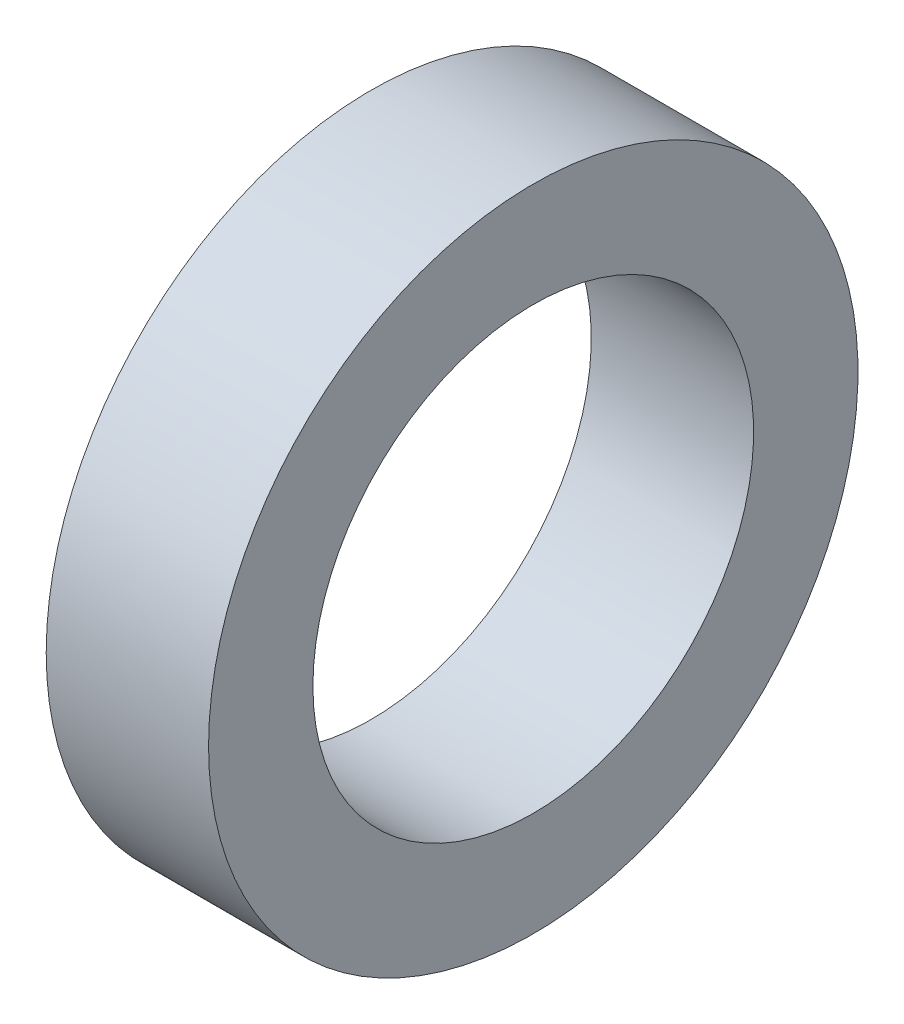
ISO-10303-21;
HEADER;
FILE_DESCRIPTION(('STEP AP214'),'2;1');
FILE_NAME('part.step','',(''),(''),'','','');
FILE_SCHEMA(('AUTOMOTIVE_DESIGN { 1 0 10303 214 1 1 1 1 }'));
ENDSEC;
DATA;
#1=APPLICATION_CONTEXT('core data for automotive mechanical design processes');
#2=APPLICATION_PROTOCOL_DEFINITION('international standard','automotive_design',2000,#1);
#3=PRODUCT_CONTEXT('',#1,'mechanical');
#4=PRODUCT('Part','Part','',(#3));
#5=PRODUCT_RELATED_PRODUCT_CATEGORY('part','',(#4));
#6=PRODUCT_DEFINITION_FORMATION('','',#4);
#7=PRODUCT_DEFINITION_CONTEXT('part definition',#1,'design');
#8=PRODUCT_DEFINITION('design','',#6,#7);
#9=PRODUCT_DEFINITION_SHAPE('','',#8);
#10=(LENGTH_UNIT() NAMED_UNIT(*) SI_UNIT(.MILLI.,.METRE.));
#11=(NAMED_UNIT(*) PLANE_ANGLE_UNIT() SI_UNIT($,.RADIAN.));
#12=(NAMED_UNIT(*) SI_UNIT($,.STERADIAN.) SOLID_ANGLE_UNIT());
#13=UNCERTAINTY_MEASURE_WITH_UNIT(LENGTH_MEASURE(1.E-05),#10,'distance_accuracy_value','');
#14=(GEOMETRIC_REPRESENTATION_CONTEXT(3) GLOBAL_UNCERTAINTY_ASSIGNED_CONTEXT((#13)) GLOBAL_UNIT_ASSIGNED_CONTEXT((#10,
#11,#12)) REPRESENTATION_CONTEXT('',''));
#15=CARTESIAN_POINT('',(0.,0.,0.));
#16=DIRECTION('',(0.,0.,1.));
#17=DIRECTION('',(1.,0.,0.));
#18=AXIS2_PLACEMENT_3D('',#15,#16,#17);
#19=CARTESIAN_POINT('',(4.7625,0.,0.));
#20=DIRECTION('',(-1.,0.,0.));
#21=DIRECTION('',(0.,0.,1.));
#22=AXIS2_PLACEMENT_3D('',#19,#20,#21);
#23=CYLINDRICAL_SURFACE('',#22,6.4643);
#24=CARTESIAN_POINT('',(0.,0.,0.));
#25=DIRECTION('',(-1.,0.,0.));
#26=DIRECTION('',(0.,0.,1.));
#27=AXIS2_PLACEMENT_3D('',#24,#25,#26);
#28=CIRCLE('',#27,6.4643);
#29=CARTESIAN_POINT('',(0.,0.,6.4643));
#30=VERTEX_POINT('',#29);
#31=EDGE_CURVE('E27',#30,#30,#28,.T.);
#32=ORIENTED_EDGE('',*,*,#31,.T.);
#33=EDGE_LOOP('',(#32));
#34=FACE_BOUND('',#33,.T.);
#35=CARTESIAN_POINT('',(4.7625,0.,0.));
#36=DIRECTION('',(-1.,0.,0.));
#37=DIRECTION('',(0.,0.,1.));
#38=AXIS2_PLACEMENT_3D('',#35,#36,#37);
#39=CIRCLE('',#38,6.4643);
#40=CARTESIAN_POINT('',(4.7625,0.,6.4643));
#41=VERTEX_POINT('',#40);
#42=EDGE_CURVE('E18',#41,#41,#39,.T.);
#43=ORIENTED_EDGE('',*,*,#42,.F.);
#44=EDGE_LOOP('',(#43));
#45=FACE_BOUND('',#44,.T.);
#46=ADVANCED_FACE('F15',(#34,#45),#23,.F.);
#47=CARTESIAN_POINT('',(4.7625,0.,0.));
#48=DIRECTION('',(1.,0.,0.));
#49=DIRECTION('',(0.,0.,-1.));
#50=AXIS2_PLACEMENT_3D('',#47,#48,#49);
#51=PLANE('',#50);
#52=ORIENTED_EDGE('',*,*,#42,.T.);
#53=EDGE_LOOP('',(#52));
#54=FACE_BOUND('',#53,.T.);
#55=CARTESIAN_POINT('',(4.7625,0.,0.));
#56=DIRECTION('',(-1.,0.,0.));
#57=DIRECTION('',(0.,0.,1.));
#58=AXIS2_PLACEMENT_3D('',#55,#56,#57);
#59=CIRCLE('',#58,9.525);
#60=CARTESIAN_POINT('',(4.7625,0.,9.525));
#61=VERTEX_POINT('',#60);
#62=EDGE_CURVE('E22',#61,#61,#59,.T.);
#63=ORIENTED_EDGE('',*,*,#62,.F.);
#64=EDGE_LOOP('',(#63));
#65=FACE_BOUND('',#64,.T.);
#66=ADVANCED_FACE('F35',(#54,#65),#51,.T.);
#67=CARTESIAN_POINT('',(0.,0.,0.));
#68=DIRECTION('',(1.,0.,0.));
#69=DIRECTION('',(0.,0.,-1.));
#70=AXIS2_PLACEMENT_3D('',#67,#68,#69);
#71=PLANE('',#70);
#72=ORIENTED_EDGE('',*,*,#31,.F.);
#73=EDGE_LOOP('',(#72));
#74=FACE_BOUND('',#73,.T.);
#75=CARTESIAN_POINT('',(0.,0.,0.));
#76=DIRECTION('',(-1.,0.,0.));
#77=DIRECTION('',(0.,0.,1.));
#78=AXIS2_PLACEMENT_3D('',#75,#76,#77);
#79=CIRCLE('',#78,9.525);
#80=CARTESIAN_POINT('',(0.,0.,9.525));
#81=VERTEX_POINT('',#80);
#82=EDGE_CURVE('E10',#81,#81,#79,.F.);
#83=ORIENTED_EDGE('',*,*,#82,.F.);
#84=EDGE_LOOP('',(#83));
#85=FACE_BOUND('',#84,.T.);
#86=ADVANCED_FACE('F43',(#74,#85),#71,.F.);
#87=CARTESIAN_POINT('',(4.7625,0.,0.));
#88=DIRECTION('',(-1.,0.,0.));
#89=DIRECTION('',(0.,0.,1.));
#90=AXIS2_PLACEMENT_3D('',#87,#88,#89);
#91=CYLINDRICAL_SURFACE('',#90,9.525);
#92=ORIENTED_EDGE('',*,*,#82,.T.);
#93=EDGE_LOOP('',(#92));
#94=FACE_BOUND('',#93,.T.);
#95=ORIENTED_EDGE('',*,*,#62,.T.);
#96=EDGE_LOOP('',(#95));
#97=FACE_BOUND('',#96,.T.);
#98=ADVANCED_FACE('F44',(#94,#97),#91,.T.);
#99=CLOSED_SHELL('',(#46,#66,#86,#98));
#100=MANIFOLD_SOLID_BREP('B1',#99);
#101=ADVANCED_BREP_SHAPE_REPRESENTATION('',(#18,#100),#14);
#102=SHAPE_DEFINITION_REPRESENTATION(#9,#101);
ENDSEC;
END-ISO-10303-21;
